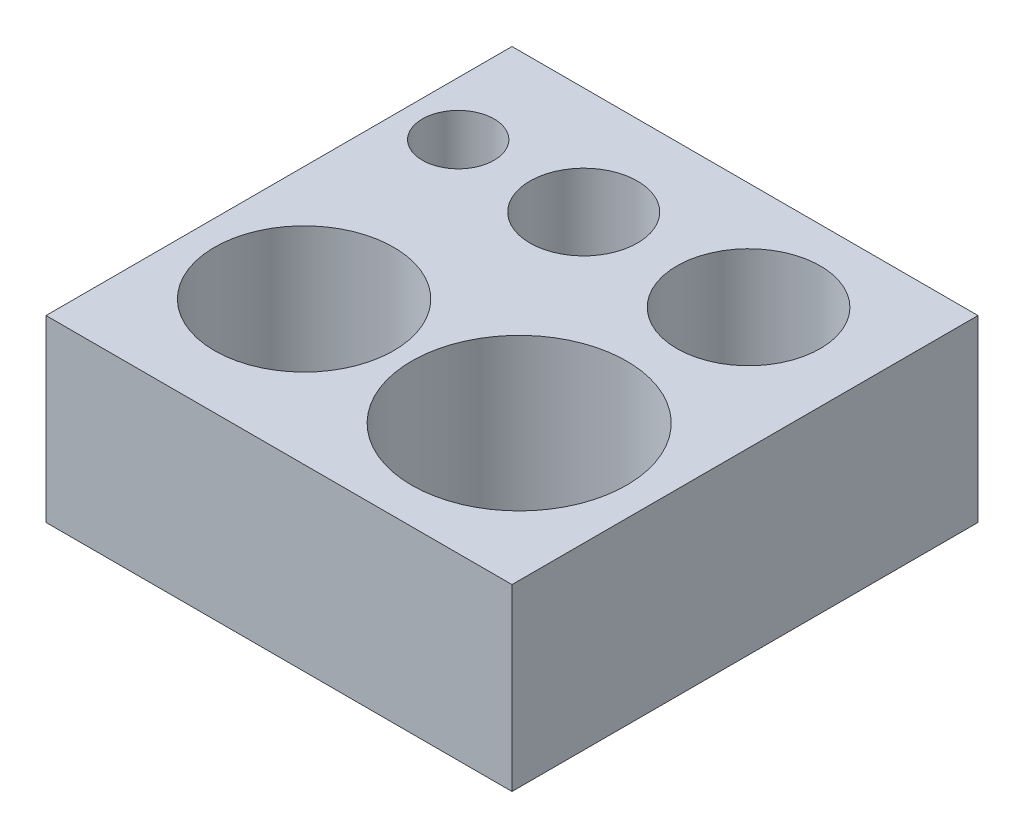
ISO-10303-21;
HEADER;
FILE_DESCRIPTION(('STEP AP214'),'2;1');
FILE_NAME('part.step','',(''),(''),'','','');
FILE_SCHEMA(('AUTOMOTIVE_DESIGN { 1 0 10303 214 1 1 1 1 }'));
ENDSEC;
DATA;
#1=APPLICATION_CONTEXT('core data for automotive mechanical design processes');
#2=APPLICATION_PROTOCOL_DEFINITION('international standard','automotive_design',2000,#1);
#3=PRODUCT_CONTEXT('',#1,'mechanical');
#4=PRODUCT('Part','Part','',(#3));
#5=PRODUCT_RELATED_PRODUCT_CATEGORY('part','',(#4));
#6=PRODUCT_DEFINITION_FORMATION('','',#4);
#7=PRODUCT_DEFINITION_CONTEXT('part definition',#1,'design');
#8=PRODUCT_DEFINITION('design','',#6,#7);
#9=PRODUCT_DEFINITION_SHAPE('','',#8);
#10=(LENGTH_UNIT() NAMED_UNIT(*) SI_UNIT(.MILLI.,.METRE.));
#11=(NAMED_UNIT(*) PLANE_ANGLE_UNIT() SI_UNIT($,.RADIAN.));
#12=(NAMED_UNIT(*) SI_UNIT($,.STERADIAN.) SOLID_ANGLE_UNIT());
#13=UNCERTAINTY_MEASURE_WITH_UNIT(LENGTH_MEASURE(1.E-05),#10,'distance_accuracy_value','');
#14=(GEOMETRIC_REPRESENTATION_CONTEXT(3) GLOBAL_UNCERTAINTY_ASSIGNED_CONTEXT((#13)) GLOBAL_UNIT_ASSIGNED_CONTEXT((#10,
#11,#12)) REPRESENTATION_CONTEXT('',''));
#15=CARTESIAN_POINT('',(0.,0.,0.));
#16=DIRECTION('',(0.,0.,1.));
#17=DIRECTION('',(1.,0.,0.));
#18=AXIS2_PLACEMENT_3D('',#15,#16,#17);
#19=CARTESIAN_POINT('',(0.,5.,0.));
#20=DIRECTION('',(0.,-1.,0.));
#21=DIRECTION('',(0.,0.,-1.));
#22=AXIS2_PLACEMENT_3D('',#19,#20,#21);
#23=PLANE('',#22);
#24=DIRECTION('',(0.,0.,1.));
#25=VECTOR('',#24,1.);
#26=CARTESIAN_POINT('',(0.,5.,0.));
#27=LINE('',#26,#25);
#28=CARTESIAN_POINT('',(0.,5.,-13.));
#29=VERTEX_POINT('',#28);
#30=CARTESIAN_POINT('',(0.,5.,0.));
#31=VERTEX_POINT('',#30);
#32=EDGE_CURVE('E88',#29,#31,#27,.T.);
#33=ORIENTED_EDGE('',*,*,#32,.T.);
#34=DIRECTION('',(1.,0.,0.));
#35=VECTOR('',#34,1.);
#36=CARTESIAN_POINT('',(0.,5.,0.));
#37=LINE('',#36,#35);
#38=CARTESIAN_POINT('',(13.,5.,0.));
#39=VERTEX_POINT('',#38);
#40=EDGE_CURVE('E83',#31,#39,#37,.T.);
#41=ORIENTED_EDGE('',*,*,#40,.T.);
#42=DIRECTION('',(0.,0.,-1.));
#43=VECTOR('',#42,1.);
#44=CARTESIAN_POINT('',(13.,5.,0.));
#45=LINE('',#44,#43);
#46=CARTESIAN_POINT('',(13.,5.,-13.));
#47=VERTEX_POINT('',#46);
#48=EDGE_CURVE('E86',#39,#47,#45,.T.);
#49=ORIENTED_EDGE('',*,*,#48,.T.);
#50=DIRECTION('',(-1.,0.,0.));
#51=VECTOR('',#50,1.);
#52=CARTESIAN_POINT('',(0.,5.,-13.));
#53=LINE('',#52,#51);
#54=EDGE_CURVE('E53',#47,#29,#53,.T.);
#55=ORIENTED_EDGE('',*,*,#54,.T.);
#56=EDGE_LOOP('',(#33,#41,#49,#55));
#57=FACE_BOUND('',#56,.T.);
#58=CARTESIAN_POINT('',(1.5,5.,-10.));
#59=DIRECTION('',(0.,1.,0.));
#60=DIRECTION('',(0.,0.,1.));
#61=AXIS2_PLACEMENT_3D('',#58,#59,#60);
#62=CIRCLE('',#61,1.);
#63=CARTESIAN_POINT('',(1.5,5.,-9.));
#64=VERTEX_POINT('',#63);
#65=EDGE_CURVE('E103',#64,#64,#62,.T.);
#66=ORIENTED_EDGE('',*,*,#65,.F.);
#67=EDGE_LOOP('',(#66));
#68=FACE_BOUND('',#67,.T.);
#69=CARTESIAN_POINT('',(5.,5.,-10.));
#70=DIRECTION('',(0.,1.,0.));
#71=DIRECTION('',(0.,0.,1.));
#72=AXIS2_PLACEMENT_3D('',#69,#70,#71);
#73=CIRCLE('',#72,1.5);
#74=CARTESIAN_POINT('',(5.,5.,-8.5));
#75=VERTEX_POINT('',#74);
#76=EDGE_CURVE('E118',#75,#75,#73,.T.);
#77=ORIENTED_EDGE('',*,*,#76,.F.);
#78=EDGE_LOOP('',(#77));
#79=FACE_BOUND('',#78,.T.);
#80=CARTESIAN_POINT('',(9.6,5.,-10.));
#81=DIRECTION('',(0.,1.,0.));
#82=DIRECTION('',(0.,0.,1.));
#83=AXIS2_PLACEMENT_3D('',#80,#81,#82);
#84=CIRCLE('',#83,2.);
#85=CARTESIAN_POINT('',(9.6,5.,-8.));
#86=VERTEX_POINT('',#85);
#87=EDGE_CURVE('E124',#86,#86,#84,.T.);
#88=ORIENTED_EDGE('',*,*,#87,.F.);
#89=EDGE_LOOP('',(#88));
#90=FACE_BOUND('',#89,.T.);
#91=CARTESIAN_POINT('',(3.2,5.,-4.));
#92=DIRECTION('',(0.,1.,0.));
#93=DIRECTION('',(0.,0.,1.));
#94=AXIS2_PLACEMENT_3D('',#91,#92,#93);
#95=CIRCLE('',#94,2.5);
#96=CARTESIAN_POINT('',(3.2,5.,-1.5));
#97=VERTEX_POINT('',#96);
#98=EDGE_CURVE('E130',#97,#97,#95,.T.);
#99=ORIENTED_EDGE('',*,*,#98,.F.);
#100=EDGE_LOOP('',(#99));
#101=FACE_BOUND('',#100,.T.);
#102=CARTESIAN_POINT('',(9.2,5.,-4.));
#103=DIRECTION('',(0.,1.,0.));
#104=DIRECTION('',(0.,0.,1.));
#105=AXIS2_PLACEMENT_3D('',#102,#103,#104);
#106=CIRCLE('',#105,3.);
#107=CARTESIAN_POINT('',(9.2,5.,-0.999999999999999));
#108=VERTEX_POINT('',#107);
#109=EDGE_CURVE('E136',#108,#108,#106,.T.);
#110=ORIENTED_EDGE('',*,*,#109,.F.);
#111=EDGE_LOOP('',(#110));
#112=FACE_BOUND('',#111,.T.);
#113=ADVANCED_FACE('F36',(#57,#68,#79,#90,#101,#112),#23,.F.);
#114=CARTESIAN_POINT('',(0.,0.,0.));
#115=DIRECTION('',(0.,-1.,0.));
#116=DIRECTION('',(0.,0.,-1.));
#117=AXIS2_PLACEMENT_3D('',#114,#115,#116);
#118=PLANE('',#117);
#119=CARTESIAN_POINT('',(3.2,0.,-4.));
#120=DIRECTION('',(0.,1.,0.));
#121=DIRECTION('',(0.,0.,1.));
#122=AXIS2_PLACEMENT_3D('',#119,#120,#121);
#123=CIRCLE('',#122,2.5);
#124=CARTESIAN_POINT('',(3.2,0.,-1.5));
#125=VERTEX_POINT('',#124);
#126=EDGE_CURVE('E133',#125,#125,#123,.T.);
#127=ORIENTED_EDGE('',*,*,#126,.T.);
#128=EDGE_LOOP('',(#127));
#129=FACE_BOUND('',#128,.T.);
#130=CARTESIAN_POINT('',(5.,0.,-10.));
#131=DIRECTION('',(0.,1.,0.));
#132=DIRECTION('',(0.,0.,1.));
#133=AXIS2_PLACEMENT_3D('',#130,#131,#132);
#134=CIRCLE('',#133,1.5);
#135=CARTESIAN_POINT('',(5.,0.,-8.5));
#136=VERTEX_POINT('',#135);
#137=EDGE_CURVE('E121',#136,#136,#134,.T.);
#138=ORIENTED_EDGE('',*,*,#137,.T.);
#139=EDGE_LOOP('',(#138));
#140=FACE_BOUND('',#139,.T.);
#141=DIRECTION('',(0.,0.,1.));
#142=VECTOR('',#141,1.);
#143=CARTESIAN_POINT('',(0.,0.,0.));
#144=LINE('',#143,#142);
#145=CARTESIAN_POINT('',(0.,0.,-13.));
#146=VERTEX_POINT('',#145);
#147=CARTESIAN_POINT('',(0.,0.,0.));
#148=VERTEX_POINT('',#147);
#149=EDGE_CURVE('E100',#146,#148,#144,.T.);
#150=ORIENTED_EDGE('',*,*,#149,.F.);
#151=DIRECTION('',(-1.,0.,0.));
#152=VECTOR('',#151,1.);
#153=CARTESIAN_POINT('',(0.,0.,-13.));
#154=LINE('',#153,#152);
#155=CARTESIAN_POINT('',(13.,0.,-13.));
#156=VERTEX_POINT('',#155);
#157=EDGE_CURVE('E76',#156,#146,#154,.T.);
#158=ORIENTED_EDGE('',*,*,#157,.F.);
#159=DIRECTION('',(0.,0.,-1.));
#160=VECTOR('',#159,1.);
#161=CARTESIAN_POINT('',(13.,0.,0.));
#162=LINE('',#161,#160);
#163=CARTESIAN_POINT('',(13.,0.,0.));
#164=VERTEX_POINT('',#163);
#165=EDGE_CURVE('E70',#164,#156,#162,.T.);
#166=ORIENTED_EDGE('',*,*,#165,.F.);
#167=DIRECTION('',(1.,0.,0.));
#168=VECTOR('',#167,1.);
#169=CARTESIAN_POINT('',(0.,0.,0.));
#170=LINE('',#169,#168);
#171=EDGE_CURVE('E92',#148,#164,#170,.T.);
#172=ORIENTED_EDGE('',*,*,#171,.F.);
#173=EDGE_LOOP('',(#150,#158,#166,#172));
#174=FACE_BOUND('',#173,.T.);
#175=CARTESIAN_POINT('',(1.5,0.,-10.));
#176=DIRECTION('',(0.,1.,0.));
#177=DIRECTION('',(0.,0.,1.));
#178=AXIS2_PLACEMENT_3D('',#175,#176,#177);
#179=CIRCLE('',#178,1.);
#180=CARTESIAN_POINT('',(1.5,0.,-9.));
#181=VERTEX_POINT('',#180);
#182=EDGE_CURVE('E115',#181,#181,#179,.T.);
#183=ORIENTED_EDGE('',*,*,#182,.T.);
#184=EDGE_LOOP('',(#183));
#185=FACE_BOUND('',#184,.T.);
#186=CARTESIAN_POINT('',(9.6,0.,-10.));
#187=DIRECTION('',(0.,1.,0.));
#188=DIRECTION('',(0.,0.,1.));
#189=AXIS2_PLACEMENT_3D('',#186,#187,#188);
#190=CIRCLE('',#189,2.);
#191=CARTESIAN_POINT('',(9.6,0.,-8.));
#192=VERTEX_POINT('',#191);
#193=EDGE_CURVE('E127',#192,#192,#190,.T.);
#194=ORIENTED_EDGE('',*,*,#193,.T.);
#195=EDGE_LOOP('',(#194));
#196=FACE_BOUND('',#195,.T.);
#197=CARTESIAN_POINT('',(9.2,0.,-4.));
#198=DIRECTION('',(0.,1.,0.));
#199=DIRECTION('',(0.,0.,1.));
#200=AXIS2_PLACEMENT_3D('',#197,#198,#199);
#201=CIRCLE('',#200,3.);
#202=CARTESIAN_POINT('',(9.2,0.,-0.999999999999999));
#203=VERTEX_POINT('',#202);
#204=EDGE_CURVE('E139',#203,#203,#201,.T.);
#205=ORIENTED_EDGE('',*,*,#204,.T.);
#206=EDGE_LOOP('',(#205));
#207=FACE_BOUND('',#206,.T.);
#208=ADVANCED_FACE('F111',(#129,#140,#174,#185,#196,#207),#118,.T.);
#209=CARTESIAN_POINT('',(0.,5.,0.));
#210=DIRECTION('',(1.,0.,0.));
#211=DIRECTION('',(0.,0.,-1.));
#212=AXIS2_PLACEMENT_3D('',#209,#210,#211);
#213=PLANE('',#212);
#214=ORIENTED_EDGE('',*,*,#149,.T.);
#215=DIRECTION('',(0.,-1.,0.));
#216=VECTOR('',#215,1.);
#217=CARTESIAN_POINT('',(0.,5.,0.));
#218=LINE('',#217,#216);
#219=EDGE_CURVE('E11',#31,#148,#218,.T.);
#220=ORIENTED_EDGE('',*,*,#219,.F.);
#221=ORIENTED_EDGE('',*,*,#32,.F.);
#222=DIRECTION('',(0.,-1.,0.));
#223=VECTOR('',#222,1.);
#224=CARTESIAN_POINT('',(0.,5.,-13.));
#225=LINE('',#224,#223);
#226=EDGE_CURVE('E96',#29,#146,#225,.T.);
#227=ORIENTED_EDGE('',*,*,#226,.T.);
#228=EDGE_LOOP('',(#214,#220,#221,#227));
#229=FACE_BOUND('',#228,.T.);
#230=ADVANCED_FACE('F38',(#229),#213,.F.);
#231=CARTESIAN_POINT('',(0.,5.,0.));
#232=DIRECTION('',(0.,0.,-1.));
#233=DIRECTION('',(-1.,0.,0.));
#234=AXIS2_PLACEMENT_3D('',#231,#232,#233);
#235=PLANE('',#234);
#236=ORIENTED_EDGE('',*,*,#171,.T.);
#237=DIRECTION('',(0.,-1.,0.));
#238=VECTOR('',#237,1.);
#239=CARTESIAN_POINT('',(13.,5.,0.));
#240=LINE('',#239,#238);
#241=EDGE_CURVE('E45',#39,#164,#240,.T.);
#242=ORIENTED_EDGE('',*,*,#241,.F.);
#243=ORIENTED_EDGE('',*,*,#40,.F.);
#244=ORIENTED_EDGE('',*,*,#219,.T.);
#245=EDGE_LOOP('',(#236,#242,#243,#244));
#246=FACE_BOUND('',#245,.T.);
#247=ADVANCED_FACE('F91',(#246),#235,.F.);
#248=CARTESIAN_POINT('',(13.,5.,0.));
#249=DIRECTION('',(-1.,0.,0.));
#250=DIRECTION('',(0.,0.,1.));
#251=AXIS2_PLACEMENT_3D('',#248,#249,#250);
#252=PLANE('',#251);
#253=ORIENTED_EDGE('',*,*,#165,.T.);
#254=DIRECTION('',(0.,-1.,0.));
#255=VECTOR('',#254,1.);
#256=CARTESIAN_POINT('',(13.,5.,-13.));
#257=LINE('',#256,#255);
#258=EDGE_CURVE('E93',#47,#156,#257,.T.);
#259=ORIENTED_EDGE('',*,*,#258,.F.);
#260=ORIENTED_EDGE('',*,*,#48,.F.);
#261=ORIENTED_EDGE('',*,*,#241,.T.);
#262=EDGE_LOOP('',(#253,#259,#260,#261));
#263=FACE_BOUND('',#262,.T.);
#264=ADVANCED_FACE('F94',(#263),#252,.F.);
#265=CARTESIAN_POINT('',(0.,5.,-13.));
#266=DIRECTION('',(0.,0.,1.));
#267=DIRECTION('',(1.,0.,0.));
#268=AXIS2_PLACEMENT_3D('',#265,#266,#267);
#269=PLANE('',#268);
#270=ORIENTED_EDGE('',*,*,#157,.T.);
#271=ORIENTED_EDGE('',*,*,#226,.F.);
#272=ORIENTED_EDGE('',*,*,#54,.F.);
#273=ORIENTED_EDGE('',*,*,#258,.T.);
#274=EDGE_LOOP('',(#270,#271,#272,#273));
#275=FACE_BOUND('',#274,.T.);
#276=ADVANCED_FACE('F108',(#275),#269,.F.);
#277=CARTESIAN_POINT('',(1.5,5.,-10.));
#278=DIRECTION('',(0.,-1.,0.));
#279=DIRECTION('',(0.,0.,-1.));
#280=AXIS2_PLACEMENT_3D('',#277,#278,#279);
#281=CYLINDRICAL_SURFACE('',#280,1.);
#282=ORIENTED_EDGE('',*,*,#65,.T.);
#283=EDGE_LOOP('',(#282));
#284=FACE_BOUND('',#283,.T.);
#285=ORIENTED_EDGE('',*,*,#182,.F.);
#286=EDGE_LOOP('',(#285));
#287=FACE_BOUND('',#286,.T.);
#288=ADVANCED_FACE('F156',(#284,#287),#281,.F.);
#289=CARTESIAN_POINT('',(5.,5.,-10.));
#290=DIRECTION('',(0.,-1.,0.));
#291=DIRECTION('',(0.,0.,-1.));
#292=AXIS2_PLACEMENT_3D('',#289,#290,#291);
#293=CYLINDRICAL_SURFACE('',#292,1.5);
#294=ORIENTED_EDGE('',*,*,#76,.T.);
#295=EDGE_LOOP('',(#294));
#296=FACE_BOUND('',#295,.T.);
#297=ORIENTED_EDGE('',*,*,#137,.F.);
#298=EDGE_LOOP('',(#297));
#299=FACE_BOUND('',#298,.T.);
#300=ADVANCED_FACE('F202',(#296,#299),#293,.F.);
#301=CARTESIAN_POINT('',(9.6,5.,-10.));
#302=DIRECTION('',(0.,-1.,0.));
#303=DIRECTION('',(0.,0.,-1.));
#304=AXIS2_PLACEMENT_3D('',#301,#302,#303);
#305=CYLINDRICAL_SURFACE('',#304,2.);
#306=ORIENTED_EDGE('',*,*,#87,.T.);
#307=EDGE_LOOP('',(#306));
#308=FACE_BOUND('',#307,.T.);
#309=ORIENTED_EDGE('',*,*,#193,.F.);
#310=EDGE_LOOP('',(#309));
#311=FACE_BOUND('',#310,.T.);
#312=ADVANCED_FACE('F210',(#308,#311),#305,.F.);
#313=CARTESIAN_POINT('',(3.2,5.,-4.));
#314=DIRECTION('',(0.,-1.,0.));
#315=DIRECTION('',(0.,0.,-1.));
#316=AXIS2_PLACEMENT_3D('',#313,#314,#315);
#317=CYLINDRICAL_SURFACE('',#316,2.5);
#318=ORIENTED_EDGE('',*,*,#98,.T.);
#319=EDGE_LOOP('',(#318));
#320=FACE_BOUND('',#319,.T.);
#321=ORIENTED_EDGE('',*,*,#126,.F.);
#322=EDGE_LOOP('',(#321));
#323=FACE_BOUND('',#322,.T.);
#324=ADVANCED_FACE('F218',(#320,#323),#317,.F.);
#325=CARTESIAN_POINT('',(9.2,5.,-4.));
#326=DIRECTION('',(0.,-1.,0.));
#327=DIRECTION('',(0.,0.,-1.));
#328=AXIS2_PLACEMENT_3D('',#325,#326,#327);
#329=CYLINDRICAL_SURFACE('',#328,3.);
#330=ORIENTED_EDGE('',*,*,#109,.T.);
#331=EDGE_LOOP('',(#330));
#332=FACE_BOUND('',#331,.T.);
#333=ORIENTED_EDGE('',*,*,#204,.F.);
#334=EDGE_LOOP('',(#333));
#335=FACE_BOUND('',#334,.T.);
#336=ADVANCED_FACE('F145',(#332,#335),#329,.F.);
#337=CLOSED_SHELL('',(#113,#208,#230,#247,#264,#276,#288,#300,#312,#324,#336));
#338=MANIFOLD_SOLID_BREP('B2',#337);
#339=ADVANCED_BREP_SHAPE_REPRESENTATION('',(#18,#338),#14);
#340=SHAPE_DEFINITION_REPRESENTATION(#9,#339);
ENDSEC;
END-ISO-10303-21;
